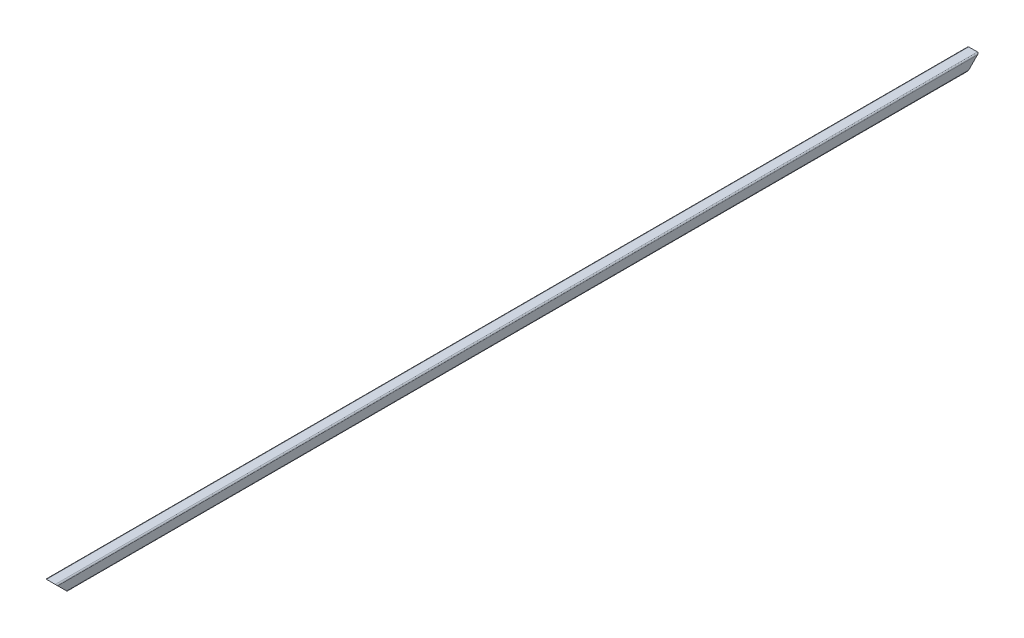
ISO-10303-21;
HEADER;
FILE_DESCRIPTION(('STEP AP214'),'2;1');
FILE_NAME('part.step','',(''),(''),'','','');
FILE_SCHEMA(('AUTOMOTIVE_DESIGN { 1 0 10303 214 1 1 1 1 }'));
ENDSEC;
DATA;
#1=APPLICATION_CONTEXT('core data for automotive mechanical design processes');
#2=APPLICATION_PROTOCOL_DEFINITION('international standard','automotive_design',2000,#1);
#3=PRODUCT_CONTEXT('',#1,'mechanical');
#4=PRODUCT('Part','Part','',(#3));
#5=PRODUCT_RELATED_PRODUCT_CATEGORY('part','',(#4));
#6=PRODUCT_DEFINITION_FORMATION('','',#4);
#7=PRODUCT_DEFINITION_CONTEXT('part definition',#1,'design');
#8=PRODUCT_DEFINITION('design','',#6,#7);
#9=PRODUCT_DEFINITION_SHAPE('','',#8);
#10=(LENGTH_UNIT() NAMED_UNIT(*) SI_UNIT(.MILLI.,.METRE.));
#11=(NAMED_UNIT(*) PLANE_ANGLE_UNIT() SI_UNIT($,.RADIAN.));
#12=(NAMED_UNIT(*) SI_UNIT($,.STERADIAN.) SOLID_ANGLE_UNIT());
#13=UNCERTAINTY_MEASURE_WITH_UNIT(LENGTH_MEASURE(1.E-05),#10,'distance_accuracy_value','');
#14=(GEOMETRIC_REPRESENTATION_CONTEXT(3) GLOBAL_UNCERTAINTY_ASSIGNED_CONTEXT((#13)) GLOBAL_UNIT_ASSIGNED_CONTEXT((#10,
#11,#12)) REPRESENTATION_CONTEXT('',''));
#15=CARTESIAN_POINT('',(0.,0.,0.));
#16=DIRECTION('',(0.,0.,1.));
#17=DIRECTION('',(1.,0.,0.));
#18=AXIS2_PLACEMENT_3D('',#15,#16,#17);
#19=CARTESIAN_POINT('',(-15.5,1940.,0.));
#20=DIRECTION('',(0.,1.,0.));
#21=DIRECTION('',(0.,0.,1.));
#22=AXIS2_PLACEMENT_3D('',#19,#20,#21);
#23=PLANE('',#22);
#24=DIRECTION('',(-1.,0.,0.));
#25=VECTOR('',#24,1.);
#26=CARTESIAN_POINT('',(-15.5,1940.,-3220.));
#27=LINE('',#26,#25);
#28=CARTESIAN_POINT('',(15.5,1940.,-3220.));
#29=VERTEX_POINT('',#28);
#30=CARTESIAN_POINT('',(-15.5,1940.,-3220.));
#31=VERTEX_POINT('',#30);
#32=EDGE_CURVE('E239',#29,#31,#27,.T.);
#33=ORIENTED_EDGE('',*,*,#32,.F.);
#34=DIRECTION('',(0.,0.,-1.));
#35=VECTOR('',#34,1.);
#36=CARTESIAN_POINT('',(15.5,1940.,0.));
#37=LINE('',#36,#35);
#38=CARTESIAN_POINT('',(15.5,1940.,-19.9999999999998));
#39=VERTEX_POINT('',#38);
#40=EDGE_CURVE('E207',#39,#29,#37,.T.);
#41=ORIENTED_EDGE('',*,*,#40,.F.);
#42=DIRECTION('',(1.,0.,0.));
#43=VECTOR('',#42,1.);
#44=CARTESIAN_POINT('',(-15.5,1940.,-19.9999999999998));
#45=LINE('',#44,#43);
#46=CARTESIAN_POINT('',(-15.5,1940.,-19.9999999999998));
#47=VERTEX_POINT('',#46);
#48=EDGE_CURVE('E279',#47,#39,#45,.T.);
#49=ORIENTED_EDGE('',*,*,#48,.F.);
#50=DIRECTION('',(0.,0.,-1.));
#51=VECTOR('',#50,1.);
#52=CARTESIAN_POINT('',(-15.5,1940.,0.));
#53=LINE('',#52,#51);
#54=EDGE_CURVE('E209',#47,#31,#53,.T.);
#55=ORIENTED_EDGE('',*,*,#54,.T.);
#56=EDGE_LOOP('',(#33,#41,#49,#55));
#57=FACE_BOUND('',#56,.T.);
#58=ADVANCED_FACE('F39',(#57),#23,.F.);
#59=CARTESIAN_POINT('',(0.,1960.,0.));
#60=DIRECTION('',(0.,-0.707106781186547,0.707106781186548));
#61=DIRECTION('',(0.,-0.707106781186548,-0.707106781186547));
#62=AXIS2_PLACEMENT_3D('',#59,#60,#61);
#63=PLANE('',#62);
#64=CARTESIAN_POINT('',(-15.,1975.,15.0000000000001));
#65=DIRECTION('',(0.,-0.707106781186547,0.707106781186548));
#66=DIRECTION('',(0.,-0.707106781186548,-0.707106781186547));
#67=AXIS2_PLACEMENT_3D('',#64,#65,#66);
#68=ELLIPSE('',#67,4.24264068711928,3.);
#69=CARTESIAN_POINT('',(-15.,1978.,18.0000000000002));
#70=VERTEX_POINT('',#69);
#71=CARTESIAN_POINT('',(-18.,1975.,15.));
#72=VERTEX_POINT('',#71);
#73=EDGE_CURVE('E170',#70,#72,#68,.T.);
#74=ORIENTED_EDGE('',*,*,#73,.F.);
#75=DIRECTION('',(-1.,0.,0.));
#76=VECTOR('',#75,1.);
#77=CARTESIAN_POINT('',(-15.,1978.,18.0000000000002));
#78=LINE('',#77,#76);
#79=CARTESIAN_POINT('',(15.,1978.,18.0000000000002));
#80=VERTEX_POINT('',#79);
#81=EDGE_CURVE('E263',#80,#70,#78,.T.);
#82=ORIENTED_EDGE('',*,*,#81,.F.);
#83=CARTESIAN_POINT('',(15.,1975.,15.0000000000001));
#84=DIRECTION('',(0.,-0.707106781186547,0.707106781186548));
#85=DIRECTION('',(0.,-0.707106781186548,-0.707106781186547));
#86=AXIS2_PLACEMENT_3D('',#83,#84,#85);
#87=ELLIPSE('',#86,4.24264068711928,3.);
#88=CARTESIAN_POINT('',(18.,1975.,15.));
#89=VERTEX_POINT('',#88);
#90=EDGE_CURVE('E260',#89,#80,#87,.T.);
#91=ORIENTED_EDGE('',*,*,#90,.F.);
#92=DIRECTION('',(0.,0.707106781186548,0.707106781186547));
#93=VECTOR('',#92,1.);
#94=CARTESIAN_POINT('',(18.,1967.5,7.50000000000006));
#95=LINE('',#94,#93);
#96=CARTESIAN_POINT('',(18.,1945.,-14.9999999999997));
#97=VERTEX_POINT('',#96);
#98=EDGE_CURVE('E257',#97,#89,#95,.T.);
#99=ORIENTED_EDGE('',*,*,#98,.F.);
#100=CARTESIAN_POINT('',(15.,1945.,-14.9999999999997));
#101=DIRECTION('',(0.,-0.707106781186547,0.707106781186548));
#102=DIRECTION('',(0.,-0.707106781186548,-0.707106781186547));
#103=AXIS2_PLACEMENT_3D('',#100,#101,#102);
#104=ELLIPSE('',#103,4.24264068711928,3.);
#105=CARTESIAN_POINT('',(15.,1942.,-17.9999999999998));
#106=VERTEX_POINT('',#105);
#107=EDGE_CURVE('E254',#106,#97,#104,.T.);
#108=ORIENTED_EDGE('',*,*,#107,.F.);
#109=DIRECTION('',(1.,0.,0.));
#110=VECTOR('',#109,1.);
#111=CARTESIAN_POINT('',(-15.,1942.,-17.9999999999998));
#112=LINE('',#111,#110);
#113=CARTESIAN_POINT('',(-15.,1942.,-17.9999999999998));
#114=VERTEX_POINT('',#113);
#115=EDGE_CURVE('E218',#114,#106,#112,.T.);
#116=ORIENTED_EDGE('',*,*,#115,.F.);
#117=CARTESIAN_POINT('',(-15.,1945.,-14.9999999999997));
#118=DIRECTION('',(0.,-0.707106781186547,0.707106781186548));
#119=DIRECTION('',(0.,-0.707106781186548,-0.707106781186547));
#120=AXIS2_PLACEMENT_3D('',#117,#118,#119);
#121=ELLIPSE('',#120,4.24264068711928,3.);
#122=CARTESIAN_POINT('',(-18.,1945.,-14.9999999999997));
#123=VERTEX_POINT('',#122);
#124=EDGE_CURVE('E216',#123,#114,#121,.T.);
#125=ORIENTED_EDGE('',*,*,#124,.F.);
#126=DIRECTION('',(0.,-0.707106781186548,-0.707106781186547));
#127=VECTOR('',#126,1.);
#128=CARTESIAN_POINT('',(-18.,1967.5,7.50000000000006));
#129=LINE('',#128,#127);
#130=EDGE_CURVE('E47',#72,#123,#129,.T.);
#131=ORIENTED_EDGE('',*,*,#130,.F.);
#132=EDGE_LOOP('',(#74,#82,#91,#99,#108,#116,#125,#131));
#133=FACE_BOUND('',#132,.T.);
#134=DIRECTION('',(-1.,0.,0.));
#135=VECTOR('',#134,1.);
#136=CARTESIAN_POINT('',(-15.5,1980.,20.0000000000002));
#137=LINE('',#136,#135);
#138=CARTESIAN_POINT('',(15.5,1980.,20.0000000000002));
#139=VERTEX_POINT('',#138);
#140=CARTESIAN_POINT('',(-15.5,1980.,20.0000000000002));
#141=VERTEX_POINT('',#140);
#142=EDGE_CURVE('E267',#139,#141,#137,.T.);
#143=ORIENTED_EDGE('',*,*,#142,.T.);
#144=CARTESIAN_POINT('',(-15.5,1975.5,15.5000000000003));
#145=DIRECTION('',(0.,-0.707106781186547,0.707106781186548));
#146=DIRECTION('',(0.,-0.707106781186548,-0.707106781186547));
#147=AXIS2_PLACEMENT_3D('',#144,#145,#146);
#148=ELLIPSE('',#147,6.36396103067893,4.5);
#149=CARTESIAN_POINT('',(-20.,1975.5,15.5000000000003));
#150=VERTEX_POINT('',#149);
#151=EDGE_CURVE('E177',#141,#150,#148,.T.);
#152=ORIENTED_EDGE('',*,*,#151,.T.);
#153=DIRECTION('',(0.,-0.707106781186548,-0.707106781186547));
#154=VECTOR('',#153,1.);
#155=CARTESIAN_POINT('',(-20.,1967.75,7.75000000000015));
#156=LINE('',#155,#154);
#157=CARTESIAN_POINT('',(-20.,1944.5,-15.4999999999998));
#158=VERTEX_POINT('',#157);
#159=EDGE_CURVE('E284',#150,#158,#156,.T.);
#160=ORIENTED_EDGE('',*,*,#159,.T.);
#161=CARTESIAN_POINT('',(-15.5,1944.5,-15.4999999999998));
#162=DIRECTION('',(0.,-0.707106781186547,0.707106781186548));
#163=DIRECTION('',(0.,-0.707106781186548,-0.707106781186547));
#164=AXIS2_PLACEMENT_3D('',#161,#162,#163);
#165=ELLIPSE('',#164,6.36396103067893,4.5);
#166=EDGE_CURVE('E282',#158,#47,#165,.T.);
#167=ORIENTED_EDGE('',*,*,#166,.T.);
#168=ORIENTED_EDGE('',*,*,#48,.T.);
#169=CARTESIAN_POINT('',(15.5,1944.5,-15.4999999999998));
#170=DIRECTION('',(0.,-0.707106781186547,0.707106781186548));
#171=DIRECTION('',(0.,-0.707106781186548,-0.707106781186547));
#172=AXIS2_PLACEMENT_3D('',#169,#170,#171);
#173=ELLIPSE('',#172,6.36396103067893,4.5);
#174=CARTESIAN_POINT('',(20.,1944.5,-15.4999999999998));
#175=VERTEX_POINT('',#174);
#176=EDGE_CURVE('E276',#39,#175,#173,.T.);
#177=ORIENTED_EDGE('',*,*,#176,.T.);
#178=DIRECTION('',(0.,0.707106781186548,0.707106781186547));
#179=VECTOR('',#178,1.);
#180=CARTESIAN_POINT('',(20.,1967.75,7.75000000000015));
#181=LINE('',#180,#179);
#182=CARTESIAN_POINT('',(20.,1975.5,15.5000000000003));
#183=VERTEX_POINT('',#182);
#184=EDGE_CURVE('E273',#175,#183,#181,.T.);
#185=ORIENTED_EDGE('',*,*,#184,.T.);
#186=CARTESIAN_POINT('',(15.5,1975.5,15.5000000000003));
#187=DIRECTION('',(0.,-0.707106781186547,0.707106781186548));
#188=DIRECTION('',(0.,-0.707106781186548,-0.707106781186547));
#189=AXIS2_PLACEMENT_3D('',#186,#187,#188);
#190=ELLIPSE('',#189,6.36396103067893,4.5);
#191=EDGE_CURVE('E270',#183,#139,#190,.T.);
#192=ORIENTED_EDGE('',*,*,#191,.T.);
#193=EDGE_LOOP('',(#143,#152,#160,#167,#168,#177,#185,#192));
#194=FACE_BOUND('',#193,.T.);
#195=ADVANCED_FACE('F213',(#133,#194),#63,.T.);
#196=CARTESIAN_POINT('',(-20.,1975.5,0.));
#197=DIRECTION('',(1.,0.,0.));
#198=DIRECTION('',(0.,0.,-1.));
#199=AXIS2_PLACEMENT_3D('',#196,#197,#198);
#200=PLANE('',#199);
#201=DIRECTION('',(0.,0.707106781186547,-0.707106781186548));
#202=VECTOR('',#201,1.);
#203=CARTESIAN_POINT('',(-20.,347.75,-1627.75));
#204=LINE('',#203,#202);
#205=CARTESIAN_POINT('',(-20.,1944.5,-3224.5));
#206=VERTEX_POINT('',#205);
#207=CARTESIAN_POINT('',(-20.,1975.5,-3255.5));
#208=VERTEX_POINT('',#207);
#209=EDGE_CURVE('E233',#206,#208,#204,.T.);
#210=ORIENTED_EDGE('',*,*,#209,.F.);
#211=DIRECTION('',(0.,0.,-1.));
#212=VECTOR('',#211,1.);
#213=CARTESIAN_POINT('',(-20.,1944.5,0.));
#214=LINE('',#213,#212);
#215=EDGE_CURVE('E174',#158,#206,#214,.T.);
#216=ORIENTED_EDGE('',*,*,#215,.F.);
#217=ORIENTED_EDGE('',*,*,#159,.F.);
#218=DIRECTION('',(0.,0.,-1.));
#219=VECTOR('',#218,1.);
#220=CARTESIAN_POINT('',(-20.,1975.5,0.));
#221=LINE('',#220,#219);
#222=EDGE_CURVE('E54',#150,#208,#221,.T.);
#223=ORIENTED_EDGE('',*,*,#222,.T.);
#224=EDGE_LOOP('',(#210,#216,#217,#223));
#225=FACE_BOUND('',#224,.T.);
#226=ADVANCED_FACE('F293',(#225),#200,.F.);
#227=CARTESIAN_POINT('',(-15.5,1944.5,0.));
#228=DIRECTION('',(0.,0.,-1.));
#229=DIRECTION('',(-1.,0.,0.));
#230=AXIS2_PLACEMENT_3D('',#227,#228,#229);
#231=CYLINDRICAL_SURFACE('',#230,4.5);
#232=CARTESIAN_POINT('',(-15.5,1944.5,-3224.5));
#233=DIRECTION('',(0.,-0.707106781186548,-0.707106781186547));
#234=DIRECTION('',(0.,0.707106781186547,-0.707106781186548));
#235=AXIS2_PLACEMENT_3D('',#232,#233,#234);
#236=ELLIPSE('',#235,6.36396103067893,4.5);
#237=EDGE_CURVE('E236',#31,#206,#236,.T.);
#238=ORIENTED_EDGE('',*,*,#237,.F.);
#239=ORIENTED_EDGE('',*,*,#54,.F.);
#240=ORIENTED_EDGE('',*,*,#166,.F.);
#241=ORIENTED_EDGE('',*,*,#215,.T.);
#242=EDGE_LOOP('',(#238,#239,#240,#241));
#243=FACE_BOUND('',#242,.T.);
#244=ADVANCED_FACE('F295',(#243),#231,.T.);
#245=CARTESIAN_POINT('',(15.5,1944.5,0.));
#246=DIRECTION('',(0.,0.,-1.));
#247=DIRECTION('',(-1.,0.,0.));
#248=AXIS2_PLACEMENT_3D('',#245,#246,#247);
#249=CYLINDRICAL_SURFACE('',#248,4.5);
#250=CARTESIAN_POINT('',(15.5,1944.5,-3224.5));
#251=DIRECTION('',(0.,-0.707106781186548,-0.707106781186547));
#252=DIRECTION('',(0.,0.707106781186547,-0.707106781186548));
#253=AXIS2_PLACEMENT_3D('',#250,#251,#252);
#254=ELLIPSE('',#253,6.36396103067893,4.5);
#255=CARTESIAN_POINT('',(20.,1944.5,-3224.5));
#256=VERTEX_POINT('',#255);
#257=EDGE_CURVE('E242',#256,#29,#254,.T.);
#258=ORIENTED_EDGE('',*,*,#257,.F.);
#259=DIRECTION('',(0.,0.,-1.));
#260=VECTOR('',#259,1.);
#261=CARTESIAN_POINT('',(20.,1944.5,0.));
#262=LINE('',#261,#260);
#263=EDGE_CURVE('E204',#175,#256,#262,.T.);
#264=ORIENTED_EDGE('',*,*,#263,.F.);
#265=ORIENTED_EDGE('',*,*,#176,.F.);
#266=ORIENTED_EDGE('',*,*,#40,.T.);
#267=EDGE_LOOP('',(#258,#264,#265,#266));
#268=FACE_BOUND('',#267,.T.);
#269=ADVANCED_FACE('F301',(#268),#249,.T.);
#270=CARTESIAN_POINT('',(20.,1975.5,0.));
#271=DIRECTION('',(-1.,0.,0.));
#272=DIRECTION('',(0.,0.,1.));
#273=AXIS2_PLACEMENT_3D('',#270,#271,#272);
#274=PLANE('',#273);
#275=DIRECTION('',(0.,-0.707106781186547,0.707106781186548));
#276=VECTOR('',#275,1.);
#277=CARTESIAN_POINT('',(20.,347.75,-1627.75));
#278=LINE('',#277,#276);
#279=CARTESIAN_POINT('',(20.,1975.5,-3255.5));
#280=VERTEX_POINT('',#279);
#281=EDGE_CURVE('E245',#280,#256,#278,.T.);
#282=ORIENTED_EDGE('',*,*,#281,.F.);
#283=DIRECTION('',(0.,0.,-1.));
#284=VECTOR('',#283,1.);
#285=CARTESIAN_POINT('',(20.,1975.5,0.));
#286=LINE('',#285,#284);
#287=EDGE_CURVE('E201',#183,#280,#286,.T.);
#288=ORIENTED_EDGE('',*,*,#287,.F.);
#289=ORIENTED_EDGE('',*,*,#184,.F.);
#290=ORIENTED_EDGE('',*,*,#263,.T.);
#291=EDGE_LOOP('',(#282,#288,#289,#290));
#292=FACE_BOUND('',#291,.T.);
#293=ADVANCED_FACE('F304',(#292),#274,.F.);
#294=CARTESIAN_POINT('',(15.5,1975.5,0.));
#295=DIRECTION('',(0.,0.,-1.));
#296=DIRECTION('',(-1.,0.,0.));
#297=AXIS2_PLACEMENT_3D('',#294,#295,#296);
#298=CYLINDRICAL_SURFACE('',#297,4.5);
#299=CARTESIAN_POINT('',(15.5,1975.5,-3255.5));
#300=DIRECTION('',(0.,-0.707106781186548,-0.707106781186547));
#301=DIRECTION('',(0.,0.707106781186547,-0.707106781186548));
#302=AXIS2_PLACEMENT_3D('',#299,#300,#301);
#303=ELLIPSE('',#302,6.36396103067893,4.5);
#304=CARTESIAN_POINT('',(15.5,1980.,-3260.));
#305=VERTEX_POINT('',#304);
#306=EDGE_CURVE('E248',#305,#280,#303,.T.);
#307=ORIENTED_EDGE('',*,*,#306,.F.);
#308=DIRECTION('',(0.,0.,-1.));
#309=VECTOR('',#308,1.);
#310=CARTESIAN_POINT('',(15.5,1980.,0.));
#311=LINE('',#310,#309);
#312=EDGE_CURVE('E198',#139,#305,#311,.T.);
#313=ORIENTED_EDGE('',*,*,#312,.F.);
#314=ORIENTED_EDGE('',*,*,#191,.F.);
#315=ORIENTED_EDGE('',*,*,#287,.T.);
#316=EDGE_LOOP('',(#307,#313,#314,#315));
#317=FACE_BOUND('',#316,.T.);
#318=ADVANCED_FACE('F307',(#317),#298,.T.);
#319=CARTESIAN_POINT('',(-15.5,1980.,0.));
#320=DIRECTION('',(0.,-1.,0.));
#321=DIRECTION('',(0.,0.,-1.));
#322=AXIS2_PLACEMENT_3D('',#319,#320,#321);
#323=PLANE('',#322);
#324=DIRECTION('',(1.,0.,0.));
#325=VECTOR('',#324,1.);
#326=CARTESIAN_POINT('',(-15.5,1980.,-3260.));
#327=LINE('',#326,#325);
#328=CARTESIAN_POINT('',(-15.5,1980.,-3260.));
#329=VERTEX_POINT('',#328);
#330=EDGE_CURVE('E221',#329,#305,#327,.T.);
#331=ORIENTED_EDGE('',*,*,#330,.F.);
#332=DIRECTION('',(0.,0.,-1.));
#333=VECTOR('',#332,1.);
#334=CARTESIAN_POINT('',(-15.5,1980.,0.));
#335=LINE('',#334,#333);
#336=EDGE_CURVE('E196',#141,#329,#335,.T.);
#337=ORIENTED_EDGE('',*,*,#336,.F.);
#338=ORIENTED_EDGE('',*,*,#142,.F.);
#339=ORIENTED_EDGE('',*,*,#312,.T.);
#340=EDGE_LOOP('',(#331,#337,#338,#339));
#341=FACE_BOUND('',#340,.T.);
#342=ADVANCED_FACE('F309',(#341),#323,.F.);
#343=CARTESIAN_POINT('',(-15.5,1975.5,0.));
#344=DIRECTION('',(0.,0.,-1.));
#345=DIRECTION('',(-1.,0.,0.));
#346=AXIS2_PLACEMENT_3D('',#343,#344,#345);
#347=CYLINDRICAL_SURFACE('',#346,4.5);
#348=CARTESIAN_POINT('',(-15.5,1975.5,-3255.5));
#349=DIRECTION('',(0.,-0.707106781186548,-0.707106781186547));
#350=DIRECTION('',(0.,0.707106781186547,-0.707106781186548));
#351=AXIS2_PLACEMENT_3D('',#348,#349,#350);
#352=ELLIPSE('',#351,6.36396103067893,4.5);
#353=EDGE_CURVE('E165',#208,#329,#352,.T.);
#354=ORIENTED_EDGE('',*,*,#353,.F.);
#355=ORIENTED_EDGE('',*,*,#222,.F.);
#356=ORIENTED_EDGE('',*,*,#151,.F.);
#357=ORIENTED_EDGE('',*,*,#336,.T.);
#358=EDGE_LOOP('',(#354,#355,#356,#357));
#359=FACE_BOUND('',#358,.T.);
#360=ADVANCED_FACE('F41',(#359),#347,.T.);
#361=CARTESIAN_POINT('',(-15.,1975.,0.));
#362=DIRECTION('',(0.,0.,-1.));
#363=DIRECTION('',(-1.,0.,0.));
#364=AXIS2_PLACEMENT_3D('',#361,#362,#363);
#365=CYLINDRICAL_SURFACE('',#364,3.);
#366=DIRECTION('',(0.,0.,-1.));
#367=VECTOR('',#366,1.);
#368=CARTESIAN_POINT('',(-18.,1975.,0.));
#369=LINE('',#368,#367);
#370=CARTESIAN_POINT('',(-18.,1975.,-3255.));
#371=VERTEX_POINT('',#370);
#372=EDGE_CURVE('E161',#72,#371,#369,.T.);
#373=ORIENTED_EDGE('',*,*,#372,.T.);
#374=CARTESIAN_POINT('',(-15.,1975.,-3255.));
#375=DIRECTION('',(0.,-0.707106781186548,-0.707106781186547));
#376=DIRECTION('',(0.,0.707106781186547,-0.707106781186548));
#377=AXIS2_PLACEMENT_3D('',#374,#375,#376);
#378=ELLIPSE('',#377,4.24264068711928,3.);
#379=CARTESIAN_POINT('',(-15.,1978.,-3258.));
#380=VERTEX_POINT('',#379);
#381=EDGE_CURVE('E11',#371,#380,#378,.T.);
#382=ORIENTED_EDGE('',*,*,#381,.T.);
#383=DIRECTION('',(0.,0.,-1.));
#384=VECTOR('',#383,1.);
#385=CARTESIAN_POINT('',(-15.,1978.,0.));
#386=LINE('',#385,#384);
#387=EDGE_CURVE('E194',#70,#380,#386,.T.);
#388=ORIENTED_EDGE('',*,*,#387,.F.);
#389=ORIENTED_EDGE('',*,*,#73,.T.);
#390=EDGE_LOOP('',(#373,#382,#388,#389));
#391=FACE_BOUND('',#390,.T.);
#392=ADVANCED_FACE('F169',(#391),#365,.F.);
#393=CARTESIAN_POINT('',(-15.,1978.,0.));
#394=DIRECTION('',(0.,-1.,0.));
#395=DIRECTION('',(0.,0.,-1.));
#396=AXIS2_PLACEMENT_3D('',#393,#394,#395);
#397=PLANE('',#396);
#398=ORIENTED_EDGE('',*,*,#387,.T.);
#399=DIRECTION('',(1.,0.,0.));
#400=VECTOR('',#399,1.);
#401=CARTESIAN_POINT('',(-15.,1978.,-3258.));
#402=LINE('',#401,#400);
#403=CARTESIAN_POINT('',(15.,1978.,-3258.));
#404=VERTEX_POINT('',#403);
#405=EDGE_CURVE('E62',#380,#404,#402,.T.);
#406=ORIENTED_EDGE('',*,*,#405,.T.);
#407=DIRECTION('',(0.,0.,-1.));
#408=VECTOR('',#407,1.);
#409=CARTESIAN_POINT('',(15.,1978.,0.));
#410=LINE('',#409,#408);
#411=EDGE_CURVE('E191',#80,#404,#410,.T.);
#412=ORIENTED_EDGE('',*,*,#411,.F.);
#413=ORIENTED_EDGE('',*,*,#81,.T.);
#414=EDGE_LOOP('',(#398,#406,#412,#413));
#415=FACE_BOUND('',#414,.T.);
#416=ADVANCED_FACE('F348',(#415),#397,.T.);
#417=CARTESIAN_POINT('',(15.,1975.,0.));
#418=DIRECTION('',(0.,0.,-1.));
#419=DIRECTION('',(-1.,0.,0.));
#420=AXIS2_PLACEMENT_3D('',#417,#418,#419);
#421=CYLINDRICAL_SURFACE('',#420,3.);
#422=ORIENTED_EDGE('',*,*,#411,.T.);
#423=CARTESIAN_POINT('',(15.,1975.,-3255.));
#424=DIRECTION('',(0.,-0.707106781186548,-0.707106781186547));
#425=DIRECTION('',(0.,0.707106781186547,-0.707106781186548));
#426=AXIS2_PLACEMENT_3D('',#423,#424,#425);
#427=ELLIPSE('',#426,4.24264068711928,3.);
#428=CARTESIAN_POINT('',(18.,1975.,-3255.));
#429=VERTEX_POINT('',#428);
#430=EDGE_CURVE('E466',#404,#429,#427,.T.);
#431=ORIENTED_EDGE('',*,*,#430,.T.);
#432=DIRECTION('',(0.,0.,-1.));
#433=VECTOR('',#432,1.);
#434=CARTESIAN_POINT('',(18.,1975.,0.));
#435=LINE('',#434,#433);
#436=EDGE_CURVE('E188',#89,#429,#435,.T.);
#437=ORIENTED_EDGE('',*,*,#436,.F.);
#438=ORIENTED_EDGE('',*,*,#90,.T.);
#439=EDGE_LOOP('',(#422,#431,#437,#438));
#440=FACE_BOUND('',#439,.T.);
#441=ADVANCED_FACE('F344',(#440),#421,.F.);
#442=CARTESIAN_POINT('',(18.,1975.,0.));
#443=DIRECTION('',(-1.,0.,0.));
#444=DIRECTION('',(0.,0.,1.));
#445=AXIS2_PLACEMENT_3D('',#442,#443,#444);
#446=PLANE('',#445);
#447=ORIENTED_EDGE('',*,*,#436,.T.);
#448=DIRECTION('',(0.,-0.707106781186547,0.707106781186548));
#449=VECTOR('',#448,1.);
#450=CARTESIAN_POINT('',(18.,347.5,-1627.5));
#451=LINE('',#450,#449);
#452=CARTESIAN_POINT('',(18.,1945.,-3225.));
#453=VERTEX_POINT('',#452);
#454=EDGE_CURVE('E468',#429,#453,#451,.T.);
#455=ORIENTED_EDGE('',*,*,#454,.T.);
#456=DIRECTION('',(0.,0.,-1.));
#457=VECTOR('',#456,1.);
#458=CARTESIAN_POINT('',(18.,1945.,0.));
#459=LINE('',#458,#457);
#460=EDGE_CURVE('E185',#97,#453,#459,.T.);
#461=ORIENTED_EDGE('',*,*,#460,.F.);
#462=ORIENTED_EDGE('',*,*,#98,.T.);
#463=EDGE_LOOP('',(#447,#455,#461,#462));
#464=FACE_BOUND('',#463,.T.);
#465=ADVANCED_FACE('F340',(#464),#446,.T.);
#466=CARTESIAN_POINT('',(15.,1945.,0.));
#467=DIRECTION('',(0.,0.,-1.));
#468=DIRECTION('',(-1.,0.,0.));
#469=AXIS2_PLACEMENT_3D('',#466,#467,#468);
#470=CYLINDRICAL_SURFACE('',#469,3.);
#471=ORIENTED_EDGE('',*,*,#460,.T.);
#472=CARTESIAN_POINT('',(15.,1945.,-3225.));
#473=DIRECTION('',(0.,-0.707106781186548,-0.707106781186547));
#474=DIRECTION('',(0.,0.707106781186547,-0.707106781186548));
#475=AXIS2_PLACEMENT_3D('',#472,#473,#474);
#476=ELLIPSE('',#475,4.24264068711928,3.);
#477=CARTESIAN_POINT('',(15.,1942.,-3222.));
#478=VERTEX_POINT('',#477);
#479=EDGE_CURVE('E227',#453,#478,#476,.T.);
#480=ORIENTED_EDGE('',*,*,#479,.T.);
#481=DIRECTION('',(0.,0.,-1.));
#482=VECTOR('',#481,1.);
#483=CARTESIAN_POINT('',(15.,1942.,0.));
#484=LINE('',#483,#482);
#485=EDGE_CURVE('E182',#106,#478,#484,.T.);
#486=ORIENTED_EDGE('',*,*,#485,.F.);
#487=ORIENTED_EDGE('',*,*,#107,.T.);
#488=EDGE_LOOP('',(#471,#480,#486,#487));
#489=FACE_BOUND('',#488,.T.);
#490=ADVANCED_FACE('F336',(#489),#470,.F.);
#491=CARTESIAN_POINT('',(-15.,1942.,0.));
#492=DIRECTION('',(0.,1.,0.));
#493=DIRECTION('',(0.,0.,1.));
#494=AXIS2_PLACEMENT_3D('',#491,#492,#493);
#495=PLANE('',#494);
#496=ORIENTED_EDGE('',*,*,#485,.T.);
#497=DIRECTION('',(-1.,0.,0.));
#498=VECTOR('',#497,1.);
#499=CARTESIAN_POINT('',(-15.,1942.,-3222.));
#500=LINE('',#499,#498);
#501=CARTESIAN_POINT('',(-15.,1942.,-3222.));
#502=VERTEX_POINT('',#501);
#503=EDGE_CURVE('E225',#478,#502,#500,.T.);
#504=ORIENTED_EDGE('',*,*,#503,.T.);
#505=DIRECTION('',(0.,0.,-1.));
#506=VECTOR('',#505,1.);
#507=CARTESIAN_POINT('',(-15.,1942.,0.));
#508=LINE('',#507,#506);
#509=EDGE_CURVE('E172',#114,#502,#508,.T.);
#510=ORIENTED_EDGE('',*,*,#509,.F.);
#511=ORIENTED_EDGE('',*,*,#115,.T.);
#512=EDGE_LOOP('',(#496,#504,#510,#511));
#513=FACE_BOUND('',#512,.T.);
#514=ADVANCED_FACE('F333',(#513),#495,.T.);
#515=CARTESIAN_POINT('',(-15.,1945.,0.));
#516=DIRECTION('',(0.,0.,-1.));
#517=DIRECTION('',(-1.,0.,0.));
#518=AXIS2_PLACEMENT_3D('',#515,#516,#517);
#519=CYLINDRICAL_SURFACE('',#518,3.);
#520=ORIENTED_EDGE('',*,*,#509,.T.);
#521=CARTESIAN_POINT('',(-15.,1945.,-3225.));
#522=DIRECTION('',(0.,-0.707106781186548,-0.707106781186547));
#523=DIRECTION('',(0.,0.707106781186547,-0.707106781186548));
#524=AXIS2_PLACEMENT_3D('',#521,#522,#523);
#525=ELLIPSE('',#524,4.24264068711928,3.);
#526=CARTESIAN_POINT('',(-18.,1945.,-3225.));
#527=VERTEX_POINT('',#526);
#528=EDGE_CURVE('E166',#502,#527,#525,.T.);
#529=ORIENTED_EDGE('',*,*,#528,.T.);
#530=DIRECTION('',(0.,0.,-1.));
#531=VECTOR('',#530,1.);
#532=CARTESIAN_POINT('',(-18.,1945.,0.));
#533=LINE('',#532,#531);
#534=EDGE_CURVE('E163',#123,#527,#533,.T.);
#535=ORIENTED_EDGE('',*,*,#534,.F.);
#536=ORIENTED_EDGE('',*,*,#124,.T.);
#537=EDGE_LOOP('',(#520,#529,#535,#536));
#538=FACE_BOUND('',#537,.T.);
#539=ADVANCED_FACE('F223',(#538),#519,.F.);
#540=CARTESIAN_POINT('',(-18.,1975.,0.));
#541=DIRECTION('',(1.,0.,0.));
#542=DIRECTION('',(0.,0.,-1.));
#543=AXIS2_PLACEMENT_3D('',#540,#541,#542);
#544=PLANE('',#543);
#545=ORIENTED_EDGE('',*,*,#534,.T.);
#546=DIRECTION('',(0.,0.707106781186547,-0.707106781186548));
#547=VECTOR('',#546,1.);
#548=CARTESIAN_POINT('',(-18.,347.5,-1627.5));
#549=LINE('',#548,#547);
#550=EDGE_CURVE('E152',#527,#371,#549,.T.);
#551=ORIENTED_EDGE('',*,*,#550,.T.);
#552=ORIENTED_EDGE('',*,*,#372,.F.);
#553=ORIENTED_EDGE('',*,*,#130,.T.);
#554=EDGE_LOOP('',(#545,#551,#552,#553));
#555=FACE_BOUND('',#554,.T.);
#556=ADVANCED_FACE('F159',(#555),#544,.T.);
#557=CARTESIAN_POINT('',(0.,1960.,-3240.));
#558=DIRECTION('',(0.,-0.707106781186548,-0.707106781186547));
#559=DIRECTION('',(0.,0.707106781186547,-0.707106781186548));
#560=AXIS2_PLACEMENT_3D('',#557,#558,#559);
#561=PLANE('',#560);
#562=ORIENTED_EDGE('',*,*,#550,.F.);
#563=ORIENTED_EDGE('',*,*,#528,.F.);
#564=ORIENTED_EDGE('',*,*,#503,.F.);
#565=ORIENTED_EDGE('',*,*,#479,.F.);
#566=ORIENTED_EDGE('',*,*,#454,.F.);
#567=ORIENTED_EDGE('',*,*,#430,.F.);
#568=ORIENTED_EDGE('',*,*,#405,.F.);
#569=ORIENTED_EDGE('',*,*,#381,.F.);
#570=EDGE_LOOP('',(#562,#563,#564,#565,#566,#567,#568,#569));
#571=FACE_BOUND('',#570,.T.);
#572=ORIENTED_EDGE('',*,*,#353,.T.);
#573=ORIENTED_EDGE('',*,*,#330,.T.);
#574=ORIENTED_EDGE('',*,*,#306,.T.);
#575=ORIENTED_EDGE('',*,*,#281,.T.);
#576=ORIENTED_EDGE('',*,*,#257,.T.);
#577=ORIENTED_EDGE('',*,*,#32,.T.);
#578=ORIENTED_EDGE('',*,*,#237,.T.);
#579=ORIENTED_EDGE('',*,*,#209,.T.);
#580=EDGE_LOOP('',(#572,#573,#574,#575,#576,#577,#578,#579));
#581=FACE_BOUND('',#580,.T.);
#582=ADVANCED_FACE('F150',(#571,#581),#561,.T.);
#583=CLOSED_SHELL('',(#58,#195,#226,#244,#269,#293,#318,#342,#360,#392,#416,#441,#465,#490,#514,
#539,#556,#582));
#584=MANIFOLD_SOLID_BREP('B2',#583);
#585=ADVANCED_BREP_SHAPE_REPRESENTATION('',(#18,#584),#14);
#586=SHAPE_DEFINITION_REPRESENTATION(#9,#585);
ENDSEC;
END-ISO-10303-21;
